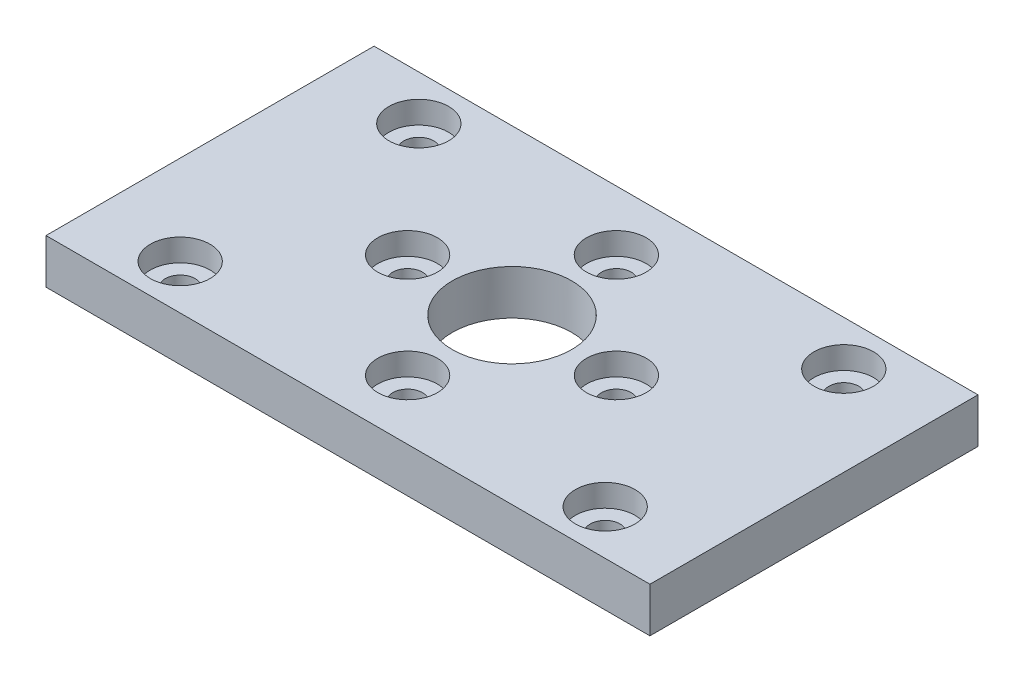
ISO-10303-21;
HEADER;
FILE_DESCRIPTION(('STEP AP214'),'2;1');
FILE_NAME('part.step','',(''),(''),'','','');
FILE_SCHEMA(('AUTOMOTIVE_DESIGN { 1 0 10303 214 1 1 1 1 }'));
ENDSEC;
DATA;
#1=APPLICATION_CONTEXT('core data for automotive mechanical design processes');
#2=APPLICATION_PROTOCOL_DEFINITION('international standard','automotive_design',2000,#1);
#3=PRODUCT_CONTEXT('',#1,'mechanical');
#4=PRODUCT('Part','Part','',(#3));
#5=PRODUCT_RELATED_PRODUCT_CATEGORY('part','',(#4));
#6=PRODUCT_DEFINITION_FORMATION('','',#4);
#7=PRODUCT_DEFINITION_CONTEXT('part definition',#1,'design');
#8=PRODUCT_DEFINITION('design','',#6,#7);
#9=PRODUCT_DEFINITION_SHAPE('','',#8);
#10=(LENGTH_UNIT() NAMED_UNIT(*) SI_UNIT(.MILLI.,.METRE.));
#11=(NAMED_UNIT(*) PLANE_ANGLE_UNIT() SI_UNIT($,.RADIAN.));
#12=(NAMED_UNIT(*) SI_UNIT($,.STERADIAN.) SOLID_ANGLE_UNIT());
#13=UNCERTAINTY_MEASURE_WITH_UNIT(LENGTH_MEASURE(1.E-05),#10,'distance_accuracy_value','');
#14=(GEOMETRIC_REPRESENTATION_CONTEXT(3) GLOBAL_UNCERTAINTY_ASSIGNED_CONTEXT((#13)) GLOBAL_UNIT_ASSIGNED_CONTEXT((#10,
#11,#12)) REPRESENTATION_CONTEXT('',''));
#15=CARTESIAN_POINT('',(0.,0.,0.));
#16=DIRECTION('',(0.,0.,1.));
#17=DIRECTION('',(1.,0.,0.));
#18=AXIS2_PLACEMENT_3D('',#15,#16,#17);
#19=CARTESIAN_POINT('',(14.25,-7.,8.));
#20=DIRECTION('',(0.,1.,0.));
#21=DIRECTION('',(0.,0.,1.));
#22=AXIS2_PLACEMENT_3D('',#19,#20,#21);
#23=CYLINDRICAL_SURFACE('',#22,1.);
#24=CARTESIAN_POINT('',(14.25,0.,8.));
#25=DIRECTION('',(0.,-1.,0.));
#26=DIRECTION('',(0.,0.,-1.));
#27=AXIS2_PLACEMENT_3D('',#24,#25,#26);
#28=CIRCLE('',#27,1.);
#29=CARTESIAN_POINT('',(14.25,0.,7.));
#30=VERTEX_POINT('',#29);
#31=EDGE_CURVE('E120',#30,#30,#28,.T.);
#32=ORIENTED_EDGE('',*,*,#31,.T.);
#33=EDGE_LOOP('',(#32));
#34=FACE_BOUND('',#33,.T.);
#35=CARTESIAN_POINT('',(14.25,1.5,8.));
#36=DIRECTION('',(0.,1.,0.));
#37=DIRECTION('',(0.,0.,1.));
#38=AXIS2_PLACEMENT_3D('',#35,#36,#37);
#39=CIRCLE('',#38,1.);
#40=CARTESIAN_POINT('',(14.25,1.5,9.));
#41=VERTEX_POINT('',#40);
#42=EDGE_CURVE('E160',#41,#41,#39,.F.);
#43=ORIENTED_EDGE('',*,*,#42,.F.);
#44=EDGE_LOOP('',(#43));
#45=FACE_BOUND('',#44,.T.);
#46=ADVANCED_FACE('F38',(#34,#45),#23,.F.);
#47=CARTESIAN_POINT('',(-14.25,-7.,8.));
#48=DIRECTION('',(0.,1.,0.));
#49=DIRECTION('',(0.,0.,1.));
#50=AXIS2_PLACEMENT_3D('',#47,#48,#49);
#51=CYLINDRICAL_SURFACE('',#50,1.);
#52=CARTESIAN_POINT('',(-14.25,0.,8.));
#53=DIRECTION('',(0.,-1.,0.));
#54=DIRECTION('',(0.,0.,-1.));
#55=AXIS2_PLACEMENT_3D('',#52,#53,#54);
#56=CIRCLE('',#55,1.);
#57=CARTESIAN_POINT('',(-14.25,0.,7.));
#58=VERTEX_POINT('',#57);
#59=EDGE_CURVE('E116',#58,#58,#56,.T.);
#60=ORIENTED_EDGE('',*,*,#59,.T.);
#61=EDGE_LOOP('',(#60));
#62=FACE_BOUND('',#61,.T.);
#63=CARTESIAN_POINT('',(-14.25,1.5,8.));
#64=DIRECTION('',(0.,1.,0.));
#65=DIRECTION('',(0.,0.,1.));
#66=AXIS2_PLACEMENT_3D('',#63,#64,#65);
#67=CIRCLE('',#66,1.);
#68=CARTESIAN_POINT('',(-14.25,1.5,9.));
#69=VERTEX_POINT('',#68);
#70=EDGE_CURVE('E158',#69,#69,#67,.F.);
#71=ORIENTED_EDGE('',*,*,#70,.F.);
#72=EDGE_LOOP('',(#71));
#73=FACE_BOUND('',#72,.T.);
#74=ADVANCED_FACE('F198',(#62,#73),#51,.F.);
#75=CARTESIAN_POINT('',(-6.9999999999998,-7.,1.98951966012828E-13));
#76=DIRECTION('',(0.,1.,0.));
#77=DIRECTION('',(0.,0.,1.));
#78=AXIS2_PLACEMENT_3D('',#75,#76,#77);
#79=CYLINDRICAL_SURFACE('',#78,1.00000000000032);
#80=CARTESIAN_POINT('',(-6.9999999999998,0.,1.98951966012828E-13));
#81=DIRECTION('',(0.,-1.,0.));
#82=DIRECTION('',(0.,0.,-1.));
#83=AXIS2_PLACEMENT_3D('',#80,#81,#82);
#84=CIRCLE('',#83,1.00000000000032);
#85=CARTESIAN_POINT('',(-6.9999999999998,0.,-1.00000000000012));
#86=VERTEX_POINT('',#85);
#87=EDGE_CURVE('E133',#86,#86,#84,.T.);
#88=ORIENTED_EDGE('',*,*,#87,.T.);
#89=EDGE_LOOP('',(#88));
#90=FACE_BOUND('',#89,.T.);
#91=CARTESIAN_POINT('',(-6.9999999999998,1.5,1.98951966012828E-13));
#92=DIRECTION('',(0.,1.,0.));
#93=DIRECTION('',(0.,0.,1.));
#94=AXIS2_PLACEMENT_3D('',#91,#92,#93);
#95=CIRCLE('',#94,1.00000000000032);
#96=CARTESIAN_POINT('',(-6.9999999999998,1.5,1.00000000000052));
#97=VERTEX_POINT('',#96);
#98=EDGE_CURVE('E152',#97,#97,#95,.F.);
#99=ORIENTED_EDGE('',*,*,#98,.F.);
#100=EDGE_LOOP('',(#99));
#101=FACE_BOUND('',#100,.T.);
#102=ADVANCED_FACE('F204',(#90,#101),#79,.F.);
#103=CARTESIAN_POINT('',(3.9618942650685E-13,-7.,7.));
#104=DIRECTION('',(0.,1.,0.));
#105=DIRECTION('',(0.,0.,1.));
#106=AXIS2_PLACEMENT_3D('',#103,#104,#105);
#107=CYLINDRICAL_SURFACE('',#106,1.00000000000043);
#108=CARTESIAN_POINT('',(3.9618942650685E-13,0.,7.));
#109=DIRECTION('',(0.,-1.,0.));
#110=DIRECTION('',(0.,0.,-1.));
#111=AXIS2_PLACEMENT_3D('',#108,#109,#110);
#112=CIRCLE('',#111,1.00000000000043);
#113=CARTESIAN_POINT('',(3.9618942650685E-13,0.,5.99999999999957));
#114=VERTEX_POINT('',#113);
#115=EDGE_CURVE('E136',#114,#114,#112,.T.);
#116=ORIENTED_EDGE('',*,*,#115,.T.);
#117=EDGE_LOOP('',(#116));
#118=FACE_BOUND('',#117,.T.);
#119=CARTESIAN_POINT('',(3.9618942650685E-13,1.5,7.));
#120=DIRECTION('',(0.,1.,0.));
#121=DIRECTION('',(0.,0.,1.));
#122=AXIS2_PLACEMENT_3D('',#119,#120,#121);
#123=CIRCLE('',#122,1.00000000000043);
#124=CARTESIAN_POINT('',(3.9618942650685E-13,1.5,8.00000000000042));
#125=VERTEX_POINT('',#124);
#126=EDGE_CURVE('E148',#125,#125,#123,.F.);
#127=ORIENTED_EDGE('',*,*,#126,.F.);
#128=EDGE_LOOP('',(#127));
#129=FACE_BOUND('',#128,.T.);
#130=ADVANCED_FACE('F228',(#118,#129),#107,.F.);
#131=CARTESIAN_POINT('',(7.0000000000002,-7.,-1.98094713253425E-13));
#132=DIRECTION('',(0.,1.,0.));
#133=DIRECTION('',(0.,0.,1.));
#134=AXIS2_PLACEMENT_3D('',#131,#132,#133);
#135=CYLINDRICAL_SURFACE('',#134,1.00000000000015);
#136=CARTESIAN_POINT('',(7.0000000000002,0.,-1.98094713253425E-13));
#137=DIRECTION('',(0.,-1.,0.));
#138=DIRECTION('',(0.,0.,-1.));
#139=AXIS2_PLACEMENT_3D('',#136,#137,#138);
#140=CIRCLE('',#139,1.00000000000015);
#141=CARTESIAN_POINT('',(7.0000000000002,0.,-1.00000000000035));
#142=VERTEX_POINT('',#141);
#143=EDGE_CURVE('E132',#142,#142,#140,.T.);
#144=ORIENTED_EDGE('',*,*,#143,.T.);
#145=EDGE_LOOP('',(#144));
#146=FACE_BOUND('',#145,.T.);
#147=CARTESIAN_POINT('',(7.0000000000002,1.5,-1.98094713253425E-13));
#148=DIRECTION('',(0.,1.,0.));
#149=DIRECTION('',(0.,0.,1.));
#150=AXIS2_PLACEMENT_3D('',#147,#148,#149);
#151=CIRCLE('',#150,1.00000000000015);
#152=CARTESIAN_POINT('',(7.0000000000002,1.5,0.999999999999957));
#153=VERTEX_POINT('',#152);
#154=EDGE_CURVE('E145',#153,#153,#151,.F.);
#155=ORIENTED_EDGE('',*,*,#154,.F.);
#156=EDGE_LOOP('',(#155));
#157=FACE_BOUND('',#156,.T.);
#158=ADVANCED_FACE('F223',(#146,#157),#135,.F.);
#159=CARTESIAN_POINT('',(20.25,3.,11.));
#160=DIRECTION('',(-1.,0.,0.));
#161=DIRECTION('',(0.,0.,1.));
#162=AXIS2_PLACEMENT_3D('',#159,#160,#161);
#163=PLANE('',#162);
#164=DIRECTION('',(0.,0.,-1.));
#165=VECTOR('',#164,1.);
#166=CARTESIAN_POINT('',(20.25,0.,11.));
#167=LINE('',#166,#165);
#168=CARTESIAN_POINT('',(20.25,0.,11.));
#169=VERTEX_POINT('',#168);
#170=CARTESIAN_POINT('',(20.25,0.,-11.));
#171=VERTEX_POINT('',#170);
#172=EDGE_CURVE('E105',#169,#171,#167,.T.);
#173=ORIENTED_EDGE('',*,*,#172,.T.);
#174=DIRECTION('',(0.,-1.,0.));
#175=VECTOR('',#174,1.);
#176=CARTESIAN_POINT('',(20.25,3.,-11.));
#177=LINE('',#176,#175);
#178=CARTESIAN_POINT('',(20.25,3.,-11.));
#179=VERTEX_POINT('',#178);
#180=EDGE_CURVE('E11',#179,#171,#177,.T.);
#181=ORIENTED_EDGE('',*,*,#180,.F.);
#182=DIRECTION('',(0.,0.,-1.));
#183=VECTOR('',#182,1.);
#184=CARTESIAN_POINT('',(20.25,3.,11.));
#185=LINE('',#184,#183);
#186=CARTESIAN_POINT('',(20.25,3.,11.));
#187=VERTEX_POINT('',#186);
#188=EDGE_CURVE('E92',#187,#179,#185,.T.);
#189=ORIENTED_EDGE('',*,*,#188,.F.);
#190=DIRECTION('',(0.,-1.,0.));
#191=VECTOR('',#190,1.);
#192=CARTESIAN_POINT('',(20.25,3.,11.));
#193=LINE('',#192,#191);
#194=EDGE_CURVE('E101',#187,#169,#193,.T.);
#195=ORIENTED_EDGE('',*,*,#194,.T.);
#196=EDGE_LOOP('',(#173,#181,#189,#195));
#197=FACE_BOUND('',#196,.T.);
#198=ADVANCED_FACE('F40',(#197),#163,.F.);
#199=CARTESIAN_POINT('',(-20.25,3.,-11.));
#200=DIRECTION('',(0.,0.,1.));
#201=DIRECTION('',(1.,0.,0.));
#202=AXIS2_PLACEMENT_3D('',#199,#200,#201);
#203=PLANE('',#202);
#204=DIRECTION('',(-1.,0.,0.));
#205=VECTOR('',#204,1.);
#206=CARTESIAN_POINT('',(-20.25,0.,-11.));
#207=LINE('',#206,#205);
#208=CARTESIAN_POINT('',(-20.25,0.,-11.));
#209=VERTEX_POINT('',#208);
#210=EDGE_CURVE('E96',#171,#209,#207,.T.);
#211=ORIENTED_EDGE('',*,*,#210,.T.);
#212=DIRECTION('',(0.,-1.,0.));
#213=VECTOR('',#212,1.);
#214=CARTESIAN_POINT('',(-20.25,3.,-11.));
#215=LINE('',#214,#213);
#216=CARTESIAN_POINT('',(-20.25,3.,-11.));
#217=VERTEX_POINT('',#216);
#218=EDGE_CURVE('E48',#217,#209,#215,.T.);
#219=ORIENTED_EDGE('',*,*,#218,.F.);
#220=DIRECTION('',(-1.,0.,0.));
#221=VECTOR('',#220,1.);
#222=CARTESIAN_POINT('',(-20.25,3.,-11.));
#223=LINE('',#222,#221);
#224=EDGE_CURVE('E87',#179,#217,#223,.T.);
#225=ORIENTED_EDGE('',*,*,#224,.F.);
#226=ORIENTED_EDGE('',*,*,#180,.T.);
#227=EDGE_LOOP('',(#211,#219,#225,#226));
#228=FACE_BOUND('',#227,.T.);
#229=ADVANCED_FACE('F95',(#228),#203,.F.);
#230=CARTESIAN_POINT('',(-20.25,3.,11.));
#231=DIRECTION('',(1.,0.,0.));
#232=DIRECTION('',(0.,0.,-1.));
#233=AXIS2_PLACEMENT_3D('',#230,#231,#232);
#234=PLANE('',#233);
#235=DIRECTION('',(0.,0.,1.));
#236=VECTOR('',#235,1.);
#237=CARTESIAN_POINT('',(-20.25,0.,11.));
#238=LINE('',#237,#236);
#239=CARTESIAN_POINT('',(-20.25,0.,11.));
#240=VERTEX_POINT('',#239);
#241=EDGE_CURVE('E74',#209,#240,#238,.T.);
#242=ORIENTED_EDGE('',*,*,#241,.T.);
#243=DIRECTION('',(0.,-1.,0.));
#244=VECTOR('',#243,1.);
#245=CARTESIAN_POINT('',(-20.25,3.,11.));
#246=LINE('',#245,#244);
#247=CARTESIAN_POINT('',(-20.25,3.,11.));
#248=VERTEX_POINT('',#247);
#249=EDGE_CURVE('E97',#248,#240,#246,.T.);
#250=ORIENTED_EDGE('',*,*,#249,.F.);
#251=DIRECTION('',(0.,0.,1.));
#252=VECTOR('',#251,1.);
#253=CARTESIAN_POINT('',(-20.25,3.,11.));
#254=LINE('',#253,#252);
#255=EDGE_CURVE('E90',#217,#248,#254,.T.);
#256=ORIENTED_EDGE('',*,*,#255,.F.);
#257=ORIENTED_EDGE('',*,*,#218,.T.);
#258=EDGE_LOOP('',(#242,#250,#256,#257));
#259=FACE_BOUND('',#258,.T.);
#260=ADVANCED_FACE('F99',(#259),#234,.F.);
#261=CARTESIAN_POINT('',(-20.25,3.,11.));
#262=DIRECTION('',(0.,0.,-1.));
#263=DIRECTION('',(-1.,0.,0.));
#264=AXIS2_PLACEMENT_3D('',#261,#262,#263);
#265=PLANE('',#264);
#266=DIRECTION('',(1.,0.,0.));
#267=VECTOR('',#266,1.);
#268=CARTESIAN_POINT('',(-20.25,0.,11.));
#269=LINE('',#268,#267);
#270=EDGE_CURVE('E80',#240,#169,#269,.T.);
#271=ORIENTED_EDGE('',*,*,#270,.T.);
#272=ORIENTED_EDGE('',*,*,#194,.F.);
#273=DIRECTION('',(1.,0.,0.));
#274=VECTOR('',#273,1.);
#275=CARTESIAN_POINT('',(-20.25,3.,11.));
#276=LINE('',#275,#274);
#277=EDGE_CURVE('E57',#248,#187,#276,.T.);
#278=ORIENTED_EDGE('',*,*,#277,.F.);
#279=ORIENTED_EDGE('',*,*,#249,.T.);
#280=EDGE_LOOP('',(#271,#272,#278,#279));
#281=FACE_BOUND('',#280,.T.);
#282=ADVANCED_FACE('F183',(#281),#265,.F.);
#283=CARTESIAN_POINT('',(0.,3.,0.));
#284=DIRECTION('',(0.,-1.,0.));
#285=DIRECTION('',(0.,0.,-1.));
#286=AXIS2_PLACEMENT_3D('',#283,#284,#285);
#287=PLANE('',#286);
#288=CARTESIAN_POINT('',(-14.25,3.,8.));
#289=DIRECTION('',(0.,1.,0.));
#290=DIRECTION('',(0.,0.,1.));
#291=AXIS2_PLACEMENT_3D('',#288,#289,#290);
#292=CIRCLE('',#291,2.);
#293=CARTESIAN_POINT('',(-14.25,3.,10.));
#294=VERTEX_POINT('',#293);
#295=EDGE_CURVE('E420',#294,#294,#292,.T.);
#296=ORIENTED_EDGE('',*,*,#295,.F.);
#297=EDGE_LOOP('',(#296));
#298=FACE_BOUND('',#297,.T.);
#299=CARTESIAN_POINT('',(3.9618942650685E-13,3.,7.));
#300=DIRECTION('',(0.,1.,0.));
#301=DIRECTION('',(0.,0.,1.));
#302=AXIS2_PLACEMENT_3D('',#299,#300,#301);
#303=CIRCLE('',#302,2.);
#304=CARTESIAN_POINT('',(3.9618942650685E-13,3.,9.));
#305=VERTEX_POINT('',#304);
#306=EDGE_CURVE('E426',#305,#305,#303,.T.);
#307=ORIENTED_EDGE('',*,*,#306,.F.);
#308=EDGE_LOOP('',(#307));
#309=FACE_BOUND('',#308,.T.);
#310=CARTESIAN_POINT('',(14.25,3.,8.));
#311=DIRECTION('',(0.,1.,0.));
#312=DIRECTION('',(0.,0.,1.));
#313=AXIS2_PLACEMENT_3D('',#310,#311,#312);
#314=CIRCLE('',#313,2.);
#315=CARTESIAN_POINT('',(14.25,3.,10.));
#316=VERTEX_POINT('',#315);
#317=EDGE_CURVE('E413',#316,#316,#314,.T.);
#318=ORIENTED_EDGE('',*,*,#317,.F.);
#319=EDGE_LOOP('',(#318));
#320=FACE_BOUND('',#319,.T.);
#321=CARTESIAN_POINT('',(-14.2500000000001,3.,-7.99999999999969));
#322=DIRECTION('',(0.,1.,0.));
#323=DIRECTION('',(0.,0.,-1.));
#324=AXIS2_PLACEMENT_3D('',#321,#322,#323);
#325=CIRCLE('',#324,2.);
#326=CARTESIAN_POINT('',(-14.2500000000001,3.,-9.99999999999969));
#327=VERTEX_POINT('',#326);
#328=EDGE_CURVE('E410',#327,#327,#325,.T.);
#329=ORIENTED_EDGE('',*,*,#328,.F.);
#330=EDGE_LOOP('',(#329));
#331=FACE_BOUND('',#330,.T.);
#332=CARTESIAN_POINT('',(-6.9999999999998,3.,1.98951966012828E-13));
#333=DIRECTION('',(0.,1.,0.));
#334=DIRECTION('',(0.,0.,1.));
#335=AXIS2_PLACEMENT_3D('',#332,#333,#334);
#336=CIRCLE('',#335,2.);
#337=CARTESIAN_POINT('',(-6.9999999999998,3.,2.0000000000002));
#338=VERTEX_POINT('',#337);
#339=EDGE_CURVE('E419',#338,#338,#336,.T.);
#340=ORIENTED_EDGE('',*,*,#339,.F.);
#341=EDGE_LOOP('',(#340));
#342=FACE_BOUND('',#341,.T.);
#343=CARTESIAN_POINT('',(7.0000000000002,3.,-1.98094713253425E-13));
#344=DIRECTION('',(0.,1.,0.));
#345=DIRECTION('',(0.,0.,1.));
#346=AXIS2_PLACEMENT_3D('',#343,#344,#345);
#347=CIRCLE('',#346,2.);
#348=CARTESIAN_POINT('',(7.0000000000002,3.,1.9999999999998));
#349=VERTEX_POINT('',#348);
#350=EDGE_CURVE('E438',#349,#349,#347,.T.);
#351=ORIENTED_EDGE('',*,*,#350,.F.);
#352=EDGE_LOOP('',(#351));
#353=FACE_BOUND('',#352,.T.);
#354=CARTESIAN_POINT('',(3.40678275275592E-13,3.,-6.99999999999981));
#355=DIRECTION('',(0.,1.,0.));
#356=DIRECTION('',(0.,0.,-1.));
#357=AXIS2_PLACEMENT_3D('',#354,#355,#356);
#358=CIRCLE('',#357,2.);
#359=CARTESIAN_POINT('',(3.40678275275592E-13,3.,-8.99999999999981));
#360=VERTEX_POINT('',#359);
#361=EDGE_CURVE('E432',#360,#360,#358,.T.);
#362=ORIENTED_EDGE('',*,*,#361,.F.);
#363=EDGE_LOOP('',(#362));
#364=FACE_BOUND('',#363,.T.);
#365=CARTESIAN_POINT('',(14.2499999999999,3.,-7.99999999999992));
#366=DIRECTION('',(0.,1.,0.));
#367=DIRECTION('',(0.,0.,-1.));
#368=AXIS2_PLACEMENT_3D('',#365,#366,#367);
#369=CIRCLE('',#368,2.);
#370=CARTESIAN_POINT('',(14.2499999999999,3.,-9.99999999999991));
#371=VERTEX_POINT('',#370);
#372=EDGE_CURVE('E165',#371,#371,#369,.T.);
#373=ORIENTED_EDGE('',*,*,#372,.F.);
#374=EDGE_LOOP('',(#373));
#375=FACE_BOUND('',#374,.T.);
#376=CARTESIAN_POINT('',(0.,3.,0.));
#377=DIRECTION('',(0.,1.,0.));
#378=DIRECTION('',(0.,0.,1.));
#379=AXIS2_PLACEMENT_3D('',#376,#377,#378);
#380=CIRCLE('',#379,4.);
#381=CARTESIAN_POINT('',(0.,3.,4.));
#382=VERTEX_POINT('',#381);
#383=EDGE_CURVE('E128',#382,#382,#380,.T.);
#384=ORIENTED_EDGE('',*,*,#383,.F.);
#385=EDGE_LOOP('',(#384));
#386=FACE_BOUND('',#385,.T.);
#387=ORIENTED_EDGE('',*,*,#188,.T.);
#388=ORIENTED_EDGE('',*,*,#224,.T.);
#389=ORIENTED_EDGE('',*,*,#255,.T.);
#390=ORIENTED_EDGE('',*,*,#277,.T.);
#391=EDGE_LOOP('',(#387,#388,#389,#390));
#392=FACE_BOUND('',#391,.T.);
#393=ADVANCED_FACE('F88',(#298,#309,#320,#331,#342,#353,#364,#375,#386,#392),#287,.F.);
#394=CARTESIAN_POINT('',(0.,0.,0.));
#395=DIRECTION('',(0.,-1.,0.));
#396=DIRECTION('',(0.,0.,-1.));
#397=AXIS2_PLACEMENT_3D('',#394,#395,#396);
#398=PLANE('',#397);
#399=ORIENTED_EDGE('',*,*,#143,.F.);
#400=EDGE_LOOP('',(#399));
#401=FACE_BOUND('',#400,.T.);
#402=ORIENTED_EDGE('',*,*,#115,.F.);
#403=EDGE_LOOP('',(#402));
#404=FACE_BOUND('',#403,.T.);
#405=ORIENTED_EDGE('',*,*,#87,.F.);
#406=EDGE_LOOP('',(#405));
#407=FACE_BOUND('',#406,.T.);
#408=CARTESIAN_POINT('',(0.,0.,-7.));
#409=DIRECTION('',(0.,-1.,0.));
#410=DIRECTION('',(0.,0.,-1.));
#411=AXIS2_PLACEMENT_3D('',#408,#409,#410);
#412=CIRCLE('',#411,1.);
#413=CARTESIAN_POINT('',(0.,0.,-8.));
#414=VERTEX_POINT('',#413);
#415=EDGE_CURVE('E129',#414,#414,#412,.T.);
#416=ORIENTED_EDGE('',*,*,#415,.F.);
#417=EDGE_LOOP('',(#416));
#418=FACE_BOUND('',#417,.T.);
#419=CARTESIAN_POINT('',(0.,0.,0.));
#420=DIRECTION('',(0.,-1.,0.));
#421=DIRECTION('',(0.,0.,-1.));
#422=AXIS2_PLACEMENT_3D('',#419,#420,#421);
#423=CIRCLE('',#422,4.);
#424=CARTESIAN_POINT('',(0.,0.,-4.));
#425=VERTEX_POINT('',#424);
#426=EDGE_CURVE('E121',#425,#425,#423,.T.);
#427=ORIENTED_EDGE('',*,*,#426,.F.);
#428=EDGE_LOOP('',(#427));
#429=FACE_BOUND('',#428,.T.);
#430=ORIENTED_EDGE('',*,*,#59,.F.);
#431=EDGE_LOOP('',(#430));
#432=FACE_BOUND('',#431,.T.);
#433=ORIENTED_EDGE('',*,*,#31,.F.);
#434=EDGE_LOOP('',(#433));
#435=FACE_BOUND('',#434,.T.);
#436=CARTESIAN_POINT('',(14.25,0.,-7.99999999999999));
#437=DIRECTION('',(0.,-1.,0.));
#438=DIRECTION('',(0.,0.,-1.));
#439=AXIS2_PLACEMENT_3D('',#436,#437,#438);
#440=CIRCLE('',#439,0.999999999999999);
#441=CARTESIAN_POINT('',(14.25,0.,-8.99999999999999));
#442=VERTEX_POINT('',#441);
#443=EDGE_CURVE('E117',#442,#442,#440,.T.);
#444=ORIENTED_EDGE('',*,*,#443,.F.);
#445=EDGE_LOOP('',(#444));
#446=FACE_BOUND('',#445,.T.);
#447=CARTESIAN_POINT('',(-14.25,0.,-8.));
#448=DIRECTION('',(0.,-1.,0.));
#449=DIRECTION('',(0.,0.,-1.));
#450=AXIS2_PLACEMENT_3D('',#447,#448,#449);
#451=CIRCLE('',#450,0.999999999999999);
#452=CARTESIAN_POINT('',(-14.25,0.,-9.));
#453=VERTEX_POINT('',#452);
#454=EDGE_CURVE('E108',#453,#453,#451,.T.);
#455=ORIENTED_EDGE('',*,*,#454,.F.);
#456=EDGE_LOOP('',(#455));
#457=FACE_BOUND('',#456,.T.);
#458=ORIENTED_EDGE('',*,*,#172,.F.);
#459=ORIENTED_EDGE('',*,*,#270,.F.);
#460=ORIENTED_EDGE('',*,*,#241,.F.);
#461=ORIENTED_EDGE('',*,*,#210,.F.);
#462=EDGE_LOOP('',(#458,#459,#460,#461));
#463=FACE_BOUND('',#462,.T.);
#464=ADVANCED_FACE('F182',(#401,#404,#407,#418,#429,#432,#435,#446,#457,#463),#398,.T.);
#465=CARTESIAN_POINT('',(-14.25,-7.,-8.));
#466=DIRECTION('',(0.,1.,0.));
#467=DIRECTION('',(0.,0.,1.));
#468=AXIS2_PLACEMENT_3D('',#465,#466,#467);
#469=CYLINDRICAL_SURFACE('',#468,0.999999999999999);
#470=CARTESIAN_POINT('',(-14.25,1.5,-8.));
#471=DIRECTION('',(0.,-1.,0.));
#472=DIRECTION('',(0.,0.,-1.));
#473=AXIS2_PLACEMENT_3D('',#470,#471,#472);
#474=CIRCLE('',#473,0.999999999999999);
#475=CARTESIAN_POINT('',(-14.25,1.5,-9.));
#476=VERTEX_POINT('',#475);
#477=EDGE_CURVE('E42',#476,#476,#474,.F.);
#478=ORIENTED_EDGE('',*,*,#477,.T.);
#479=EDGE_LOOP('',(#478));
#480=FACE_BOUND('',#479,.T.);
#481=ORIENTED_EDGE('',*,*,#454,.T.);
#482=EDGE_LOOP('',(#481));
#483=FACE_BOUND('',#482,.T.);
#484=ADVANCED_FACE('F190',(#480,#483),#469,.F.);
#485=CARTESIAN_POINT('',(14.25,-7.,-7.99999999999999));
#486=DIRECTION('',(0.,1.,0.));
#487=DIRECTION('',(0.,0.,1.));
#488=AXIS2_PLACEMENT_3D('',#485,#486,#487);
#489=CYLINDRICAL_SURFACE('',#488,0.999999999999999);
#490=CARTESIAN_POINT('',(14.25,1.5,-7.99999999999999));
#491=DIRECTION('',(0.,-1.,0.));
#492=DIRECTION('',(0.,0.,-1.));
#493=AXIS2_PLACEMENT_3D('',#490,#491,#492);
#494=CIRCLE('',#493,0.999999999999999);
#495=CARTESIAN_POINT('',(14.25,1.5,-8.99999999999999));
#496=VERTEX_POINT('',#495);
#497=EDGE_CURVE('E137',#496,#496,#494,.F.);
#498=ORIENTED_EDGE('',*,*,#497,.T.);
#499=EDGE_LOOP('',(#498));
#500=FACE_BOUND('',#499,.T.);
#501=ORIENTED_EDGE('',*,*,#443,.T.);
#502=EDGE_LOOP('',(#501));
#503=FACE_BOUND('',#502,.T.);
#504=ADVANCED_FACE('F210',(#500,#503),#489,.F.);
#505=CARTESIAN_POINT('',(0.,-7.,0.));
#506=DIRECTION('',(0.,1.,0.));
#507=DIRECTION('',(0.,0.,1.));
#508=AXIS2_PLACEMENT_3D('',#505,#506,#507);
#509=CYLINDRICAL_SURFACE('',#508,4.);
#510=ORIENTED_EDGE('',*,*,#426,.T.);
#511=EDGE_LOOP('',(#510));
#512=FACE_BOUND('',#511,.T.);
#513=ORIENTED_EDGE('',*,*,#383,.T.);
#514=EDGE_LOOP('',(#513));
#515=FACE_BOUND('',#514,.T.);
#516=ADVANCED_FACE('F179',(#512,#515),#509,.F.);
#517=CARTESIAN_POINT('',(0.,-7.,-7.));
#518=DIRECTION('',(0.,1.,0.));
#519=DIRECTION('',(0.,0.,1.));
#520=AXIS2_PLACEMENT_3D('',#517,#518,#519);
#521=CYLINDRICAL_SURFACE('',#520,1.);
#522=CARTESIAN_POINT('',(0.,1.5,-7.));
#523=DIRECTION('',(0.,-1.,0.));
#524=DIRECTION('',(0.,0.,-1.));
#525=AXIS2_PLACEMENT_3D('',#522,#523,#524);
#526=CIRCLE('',#525,1.);
#527=CARTESIAN_POINT('',(0.,1.5,-8.));
#528=VERTEX_POINT('',#527);
#529=EDGE_CURVE('E155',#528,#528,#526,.F.);
#530=ORIENTED_EDGE('',*,*,#529,.T.);
#531=EDGE_LOOP('',(#530));
#532=FACE_BOUND('',#531,.T.);
#533=ORIENTED_EDGE('',*,*,#415,.T.);
#534=EDGE_LOOP('',(#533));
#535=FACE_BOUND('',#534,.T.);
#536=ADVANCED_FACE('F244',(#532,#535),#521,.F.);
#537=CARTESIAN_POINT('',(14.2499999999999,1.5,-7.99999999999992));
#538=DIRECTION('',(0.,-1.,0.));
#539=DIRECTION('',(0.,0.,-1.));
#540=AXIS2_PLACEMENT_3D('',#537,#538,#539);
#541=PLANE('',#540);
#542=CARTESIAN_POINT('',(14.2499999999999,1.5,-7.99999999999992));
#543=DIRECTION('',(0.,1.,0.));
#544=DIRECTION('',(0.,0.,-1.));
#545=AXIS2_PLACEMENT_3D('',#542,#543,#544);
#546=CIRCLE('',#545,2.);
#547=CARTESIAN_POINT('',(14.2499999999999,1.5,-9.99999999999991));
#548=VERTEX_POINT('',#547);
#549=EDGE_CURVE('E144',#548,#548,#546,.T.);
#550=ORIENTED_EDGE('',*,*,#549,.T.);
#551=EDGE_LOOP('',(#550));
#552=FACE_BOUND('',#551,.T.);
#553=ORIENTED_EDGE('',*,*,#497,.F.);
#554=EDGE_LOOP('',(#553));
#555=FACE_BOUND('',#554,.T.);
#556=ADVANCED_FACE('F246',(#552,#555),#541,.F.);
#557=CARTESIAN_POINT('',(14.2499999999999,1.5,-7.99999999999992));
#558=DIRECTION('',(0.,1.,0.));
#559=DIRECTION('',(0.,0.,1.));
#560=AXIS2_PLACEMENT_3D('',#557,#558,#559);
#561=CYLINDRICAL_SURFACE('',#560,2.);
#562=ORIENTED_EDGE('',*,*,#549,.F.);
#563=EDGE_LOOP('',(#562));
#564=FACE_BOUND('',#563,.T.);
#565=ORIENTED_EDGE('',*,*,#372,.T.);
#566=EDGE_LOOP('',(#565));
#567=FACE_BOUND('',#566,.T.);
#568=ADVANCED_FACE('F238',(#564,#567),#561,.F.);
#569=CARTESIAN_POINT('',(7.0000000000002,1.5,-1.98094713253425E-13));
#570=DIRECTION('',(0.,1.,0.));
#571=DIRECTION('',(0.,0.,1.));
#572=AXIS2_PLACEMENT_3D('',#569,#570,#571);
#573=PLANE('',#572);
#574=CARTESIAN_POINT('',(7.0000000000002,1.5,-1.98094713253425E-13));
#575=DIRECTION('',(0.,1.,0.));
#576=DIRECTION('',(0.,0.,1.));
#577=AXIS2_PLACEMENT_3D('',#574,#575,#576);
#578=CIRCLE('',#577,2.);
#579=CARTESIAN_POINT('',(7.0000000000002,1.5,1.9999999999998));
#580=VERTEX_POINT('',#579);
#581=EDGE_CURVE('E435',#580,#580,#578,.T.);
#582=ORIENTED_EDGE('',*,*,#581,.T.);
#583=EDGE_LOOP('',(#582));
#584=FACE_BOUND('',#583,.T.);
#585=ORIENTED_EDGE('',*,*,#154,.T.);
#586=EDGE_LOOP('',(#585));
#587=FACE_BOUND('',#586,.T.);
#588=ADVANCED_FACE('F299',(#584,#587),#573,.T.);
#589=CARTESIAN_POINT('',(7.0000000000002,1.5,-1.98094713253425E-13));
#590=DIRECTION('',(0.,1.,0.));
#591=DIRECTION('',(0.,0.,1.));
#592=AXIS2_PLACEMENT_3D('',#589,#590,#591);
#593=CYLINDRICAL_SURFACE('',#592,2.);
#594=ORIENTED_EDGE('',*,*,#581,.F.);
#595=EDGE_LOOP('',(#594));
#596=FACE_BOUND('',#595,.T.);
#597=ORIENTED_EDGE('',*,*,#350,.T.);
#598=EDGE_LOOP('',(#597));
#599=FACE_BOUND('',#598,.T.);
#600=ADVANCED_FACE('F289',(#596,#599),#593,.F.);
#601=CARTESIAN_POINT('',(3.9618942650685E-13,1.5,7.));
#602=DIRECTION('',(0.,1.,0.));
#603=DIRECTION('',(0.,0.,1.));
#604=AXIS2_PLACEMENT_3D('',#601,#602,#603);
#605=PLANE('',#604);
#606=CARTESIAN_POINT('',(3.9618942650685E-13,1.5,7.));
#607=DIRECTION('',(0.,1.,0.));
#608=DIRECTION('',(0.,0.,1.));
#609=AXIS2_PLACEMENT_3D('',#606,#607,#608);
#610=CIRCLE('',#609,2.);
#611=CARTESIAN_POINT('',(3.9618942650685E-13,1.5,9.));
#612=VERTEX_POINT('',#611);
#613=EDGE_CURVE('E423',#612,#612,#610,.T.);
#614=ORIENTED_EDGE('',*,*,#613,.T.);
#615=EDGE_LOOP('',(#614));
#616=FACE_BOUND('',#615,.T.);
#617=ORIENTED_EDGE('',*,*,#126,.T.);
#618=EDGE_LOOP('',(#617));
#619=FACE_BOUND('',#618,.T.);
#620=ADVANCED_FACE('F285',(#616,#619),#605,.T.);
#621=CARTESIAN_POINT('',(3.9618942650685E-13,1.5,7.));
#622=DIRECTION('',(0.,1.,0.));
#623=DIRECTION('',(0.,0.,1.));
#624=AXIS2_PLACEMENT_3D('',#621,#622,#623);
#625=CYLINDRICAL_SURFACE('',#624,2.);
#626=ORIENTED_EDGE('',*,*,#613,.F.);
#627=EDGE_LOOP('',(#626));
#628=FACE_BOUND('',#627,.T.);
#629=ORIENTED_EDGE('',*,*,#306,.T.);
#630=EDGE_LOOP('',(#629));
#631=FACE_BOUND('',#630,.T.);
#632=ADVANCED_FACE('F288',(#628,#631),#625,.F.);
#633=CARTESIAN_POINT('',(-6.9999999999998,1.5,1.98951966012828E-13));
#634=DIRECTION('',(0.,1.,0.));
#635=DIRECTION('',(0.,0.,1.));
#636=AXIS2_PLACEMENT_3D('',#633,#634,#635);
#637=PLANE('',#636);
#638=CARTESIAN_POINT('',(-6.9999999999998,1.5,1.98951966012828E-13));
#639=DIRECTION('',(0.,1.,0.));
#640=DIRECTION('',(0.,0.,1.));
#641=AXIS2_PLACEMENT_3D('',#638,#639,#640);
#642=CIRCLE('',#641,2.);
#643=CARTESIAN_POINT('',(-6.9999999999998,1.5,2.0000000000002));
#644=VERTEX_POINT('',#643);
#645=EDGE_CURVE('E441',#644,#644,#642,.T.);
#646=ORIENTED_EDGE('',*,*,#645,.T.);
#647=EDGE_LOOP('',(#646));
#648=FACE_BOUND('',#647,.T.);
#649=ORIENTED_EDGE('',*,*,#98,.T.);
#650=EDGE_LOOP('',(#649));
#651=FACE_BOUND('',#650,.T.);
#652=ADVANCED_FACE('F293',(#648,#651),#637,.T.);
#653=CARTESIAN_POINT('',(-6.9999999999998,1.5,1.98951966012828E-13));
#654=DIRECTION('',(0.,1.,0.));
#655=DIRECTION('',(0.,0.,1.));
#656=AXIS2_PLACEMENT_3D('',#653,#654,#655);
#657=CYLINDRICAL_SURFACE('',#656,2.);
#658=ORIENTED_EDGE('',*,*,#645,.F.);
#659=EDGE_LOOP('',(#658));
#660=FACE_BOUND('',#659,.T.);
#661=ORIENTED_EDGE('',*,*,#339,.T.);
#662=EDGE_LOOP('',(#661));
#663=FACE_BOUND('',#662,.T.);
#664=ADVANCED_FACE('F296',(#660,#663),#657,.F.);
#665=CARTESIAN_POINT('',(3.40678275275592E-13,1.5,-6.99999999999981));
#666=DIRECTION('',(0.,-1.,0.));
#667=DIRECTION('',(0.,0.,-1.));
#668=AXIS2_PLACEMENT_3D('',#665,#666,#667);
#669=PLANE('',#668);
#670=CARTESIAN_POINT('',(3.40678275275592E-13,1.5,-6.99999999999981));
#671=DIRECTION('',(0.,1.,0.));
#672=DIRECTION('',(0.,0.,-1.));
#673=AXIS2_PLACEMENT_3D('',#670,#671,#672);
#674=CIRCLE('',#673,2.);
#675=CARTESIAN_POINT('',(3.40678275275592E-13,1.5,-8.99999999999981));
#676=VERTEX_POINT('',#675);
#677=EDGE_CURVE('E149',#676,#676,#674,.T.);
#678=ORIENTED_EDGE('',*,*,#677,.T.);
#679=EDGE_LOOP('',(#678));
#680=FACE_BOUND('',#679,.T.);
#681=ORIENTED_EDGE('',*,*,#529,.F.);
#682=EDGE_LOOP('',(#681));
#683=FACE_BOUND('',#682,.T.);
#684=ADVANCED_FACE('F277',(#680,#683),#669,.F.);
#685=CARTESIAN_POINT('',(3.40678275275592E-13,1.5,-6.99999999999981));
#686=DIRECTION('',(0.,1.,0.));
#687=DIRECTION('',(0.,0.,1.));
#688=AXIS2_PLACEMENT_3D('',#685,#686,#687);
#689=CYLINDRICAL_SURFACE('',#688,2.);
#690=ORIENTED_EDGE('',*,*,#677,.F.);
#691=EDGE_LOOP('',(#690));
#692=FACE_BOUND('',#691,.T.);
#693=ORIENTED_EDGE('',*,*,#361,.T.);
#694=EDGE_LOOP('',(#693));
#695=FACE_BOUND('',#694,.T.);
#696=ADVANCED_FACE('F267',(#692,#695),#689,.F.);
#697=CARTESIAN_POINT('',(-14.25,1.5,8.));
#698=DIRECTION('',(0.,1.,0.));
#699=DIRECTION('',(0.,0.,1.));
#700=AXIS2_PLACEMENT_3D('',#697,#698,#699);
#701=PLANE('',#700);
#702=CARTESIAN_POINT('',(-14.25,1.5,8.));
#703=DIRECTION('',(0.,1.,0.));
#704=DIRECTION('',(0.,0.,1.));
#705=AXIS2_PLACEMENT_3D('',#702,#703,#704);
#706=CIRCLE('',#705,2.);
#707=CARTESIAN_POINT('',(-14.25,1.5,10.));
#708=VERTEX_POINT('',#707);
#709=EDGE_CURVE('E417',#708,#708,#706,.T.);
#710=ORIENTED_EDGE('',*,*,#709,.T.);
#711=EDGE_LOOP('',(#710));
#712=FACE_BOUND('',#711,.T.);
#713=ORIENTED_EDGE('',*,*,#70,.T.);
#714=EDGE_LOOP('',(#713));
#715=FACE_BOUND('',#714,.T.);
#716=ADVANCED_FACE('F264',(#712,#715),#701,.T.);
#717=CARTESIAN_POINT('',(-14.25,1.5,8.));
#718=DIRECTION('',(0.,1.,0.));
#719=DIRECTION('',(0.,0.,1.));
#720=AXIS2_PLACEMENT_3D('',#717,#718,#719);
#721=CYLINDRICAL_SURFACE('',#720,2.);
#722=ORIENTED_EDGE('',*,*,#709,.F.);
#723=EDGE_LOOP('',(#722));
#724=FACE_BOUND('',#723,.T.);
#725=ORIENTED_EDGE('',*,*,#295,.T.);
#726=EDGE_LOOP('',(#725));
#727=FACE_BOUND('',#726,.T.);
#728=ADVANCED_FACE('F266',(#724,#727),#721,.F.);
#729=CARTESIAN_POINT('',(14.25,1.5,8.));
#730=DIRECTION('',(0.,1.,0.));
#731=DIRECTION('',(0.,0.,1.));
#732=AXIS2_PLACEMENT_3D('',#729,#730,#731);
#733=PLANE('',#732);
#734=CARTESIAN_POINT('',(14.25,1.5,8.));
#735=DIRECTION('',(0.,1.,0.));
#736=DIRECTION('',(0.,0.,1.));
#737=AXIS2_PLACEMENT_3D('',#734,#735,#736);
#738=CIRCLE('',#737,2.);
#739=CARTESIAN_POINT('',(14.25,1.5,10.));
#740=VERTEX_POINT('',#739);
#741=EDGE_CURVE('E429',#740,#740,#738,.T.);
#742=ORIENTED_EDGE('',*,*,#741,.T.);
#743=EDGE_LOOP('',(#742));
#744=FACE_BOUND('',#743,.T.);
#745=ORIENTED_EDGE('',*,*,#42,.T.);
#746=EDGE_LOOP('',(#745));
#747=FACE_BOUND('',#746,.T.);
#748=ADVANCED_FACE('F274',(#744,#747),#733,.T.);
#749=CARTESIAN_POINT('',(14.25,1.5,8.));
#750=DIRECTION('',(0.,1.,0.));
#751=DIRECTION('',(0.,0.,1.));
#752=AXIS2_PLACEMENT_3D('',#749,#750,#751);
#753=CYLINDRICAL_SURFACE('',#752,2.);
#754=ORIENTED_EDGE('',*,*,#741,.F.);
#755=EDGE_LOOP('',(#754));
#756=FACE_BOUND('',#755,.T.);
#757=ORIENTED_EDGE('',*,*,#317,.T.);
#758=EDGE_LOOP('',(#757));
#759=FACE_BOUND('',#758,.T.);
#760=ADVANCED_FACE('F373',(#756,#759),#753,.F.);
#761=CARTESIAN_POINT('',(-14.2500000000001,1.5,-7.99999999999969));
#762=DIRECTION('',(0.,-1.,0.));
#763=DIRECTION('',(0.,0.,-1.));
#764=AXIS2_PLACEMENT_3D('',#761,#762,#763);
#765=PLANE('',#764);
#766=CARTESIAN_POINT('',(-14.2500000000001,1.5,-7.99999999999969));
#767=DIRECTION('',(0.,1.,0.));
#768=DIRECTION('',(0.,0.,-1.));
#769=AXIS2_PLACEMENT_3D('',#766,#767,#768);
#770=CIRCLE('',#769,2.);
#771=CARTESIAN_POINT('',(-14.2500000000001,1.5,-9.99999999999969));
#772=VERTEX_POINT('',#771);
#773=EDGE_CURVE('E407',#772,#772,#770,.T.);
#774=ORIENTED_EDGE('',*,*,#773,.T.);
#775=EDGE_LOOP('',(#774));
#776=FACE_BOUND('',#775,.T.);
#777=ORIENTED_EDGE('',*,*,#477,.F.);
#778=EDGE_LOOP('',(#777));
#779=FACE_BOUND('',#778,.T.);
#780=ADVANCED_FACE('F383',(#776,#779),#765,.F.);
#781=CARTESIAN_POINT('',(-14.2500000000001,1.5,-7.99999999999969));
#782=DIRECTION('',(0.,1.,0.));
#783=DIRECTION('',(0.,0.,1.));
#784=AXIS2_PLACEMENT_3D('',#781,#782,#783);
#785=CYLINDRICAL_SURFACE('',#784,2.);
#786=ORIENTED_EDGE('',*,*,#773,.F.);
#787=EDGE_LOOP('',(#786));
#788=FACE_BOUND('',#787,.T.);
#789=ORIENTED_EDGE('',*,*,#328,.T.);
#790=EDGE_LOOP('',(#789));
#791=FACE_BOUND('',#790,.T.);
#792=ADVANCED_FACE('F282',(#788,#791),#785,.F.);
#793=CLOSED_SHELL('',(#46,#74,#102,#130,#158,#198,#229,#260,#282,#393,#464,#484,#504,#516,#536,
#556,#568,#588,#600,#620,#632,#652,#664,#684,#696,#716,#728,#748,#760,#780,#792));
#794=MANIFOLD_SOLID_BREP('B2',#793);
#795=ADVANCED_BREP_SHAPE_REPRESENTATION('',(#18,#794),#14);
#796=SHAPE_DEFINITION_REPRESENTATION(#9,#795);
ENDSEC;
END-ISO-10303-21;
